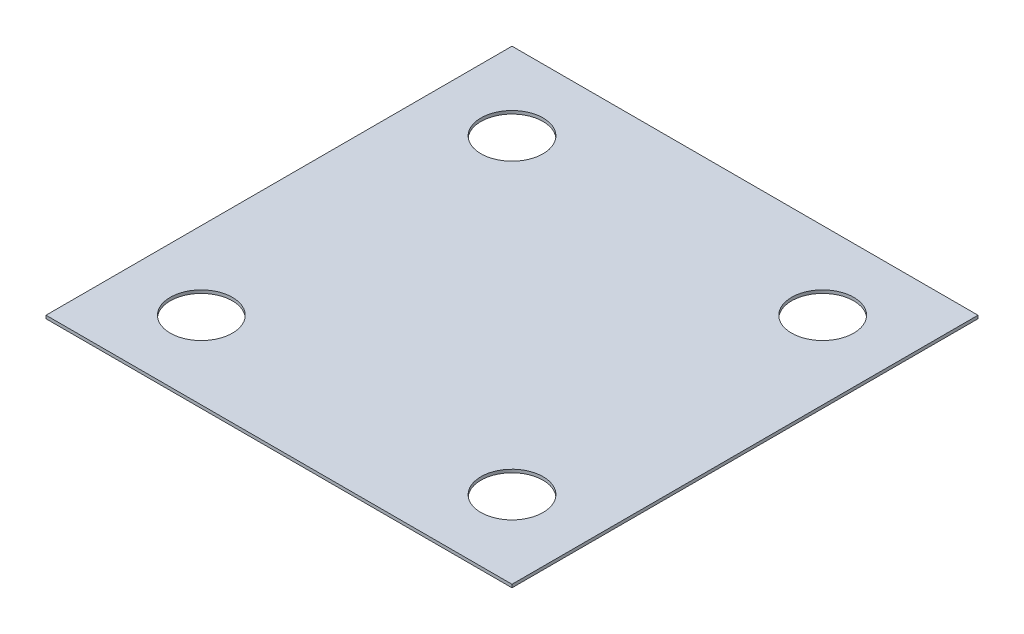
ISO-10303-21;
HEADER;
FILE_DESCRIPTION(('STEP AP214'),'2;1');
FILE_NAME('part.step','',(''),(''),'','','');
FILE_SCHEMA(('AUTOMOTIVE_DESIGN { 1 0 10303 214 1 1 1 1 }'));
ENDSEC;
DATA;
#1=APPLICATION_CONTEXT('core data for automotive mechanical design processes');
#2=APPLICATION_PROTOCOL_DEFINITION('international standard','automotive_design',2000,#1);
#3=PRODUCT_CONTEXT('',#1,'mechanical');
#4=PRODUCT('Part','Part','',(#3));
#5=PRODUCT_RELATED_PRODUCT_CATEGORY('part','',(#4));
#6=PRODUCT_DEFINITION_FORMATION('','',#4);
#7=PRODUCT_DEFINITION_CONTEXT('part definition',#1,'design');
#8=PRODUCT_DEFINITION('design','',#6,#7);
#9=PRODUCT_DEFINITION_SHAPE('','',#8);
#10=(LENGTH_UNIT() NAMED_UNIT(*) SI_UNIT(.MILLI.,.METRE.));
#11=(NAMED_UNIT(*) PLANE_ANGLE_UNIT() SI_UNIT($,.RADIAN.));
#12=(NAMED_UNIT(*) SI_UNIT($,.STERADIAN.) SOLID_ANGLE_UNIT());
#13=UNCERTAINTY_MEASURE_WITH_UNIT(LENGTH_MEASURE(1.E-05),#10,'distance_accuracy_value','');
#14=(GEOMETRIC_REPRESENTATION_CONTEXT(3) GLOBAL_UNCERTAINTY_ASSIGNED_CONTEXT((#13)) GLOBAL_UNIT_ASSIGNED_CONTEXT((#10,
#11,#12)) REPRESENTATION_CONTEXT('',''));
#15=CARTESIAN_POINT('',(0.,0.,0.));
#16=DIRECTION('',(0.,0.,1.));
#17=DIRECTION('',(1.,0.,0.));
#18=AXIS2_PLACEMENT_3D('',#15,#16,#17);
#19=CARTESIAN_POINT('',(150.,-2.,150.));
#20=DIRECTION('',(1.,0.,0.));
#21=DIRECTION('',(0.,0.,-1.));
#22=AXIS2_PLACEMENT_3D('',#19,#20,#21);
#23=PLANE('',#22);
#24=DIRECTION('',(0.,0.,-1.));
#25=VECTOR('',#24,1.);
#26=CARTESIAN_POINT('',(150.,0.,150.));
#27=LINE('',#26,#25);
#28=CARTESIAN_POINT('',(150.,0.,150.));
#29=VERTEX_POINT('',#28);
#30=CARTESIAN_POINT('',(150.,0.,-150.));
#31=VERTEX_POINT('',#30);
#32=EDGE_CURVE('E104',#29,#31,#27,.T.);
#33=ORIENTED_EDGE('',*,*,#32,.F.);
#34=DIRECTION('',(0.,1.,0.));
#35=VECTOR('',#34,1.);
#36=CARTESIAN_POINT('',(150.,-2.,150.));
#37=LINE('',#36,#35);
#38=CARTESIAN_POINT('',(150.,-2.,150.));
#39=VERTEX_POINT('',#38);
#40=EDGE_CURVE('E11',#39,#29,#37,.T.);
#41=ORIENTED_EDGE('',*,*,#40,.F.);
#42=DIRECTION('',(0.,0.,-1.));
#43=VECTOR('',#42,1.);
#44=CARTESIAN_POINT('',(150.,-2.,150.));
#45=LINE('',#44,#43);
#46=CARTESIAN_POINT('',(150.,-2.,-150.));
#47=VERTEX_POINT('',#46);
#48=EDGE_CURVE('E97',#39,#47,#45,.T.);
#49=ORIENTED_EDGE('',*,*,#48,.T.);
#50=DIRECTION('',(0.,1.,0.));
#51=VECTOR('',#50,1.);
#52=CARTESIAN_POINT('',(150.,-2.,-150.));
#53=LINE('',#52,#51);
#54=EDGE_CURVE('E42',#47,#31,#53,.T.);
#55=ORIENTED_EDGE('',*,*,#54,.T.);
#56=EDGE_LOOP('',(#33,#41,#49,#55));
#57=FACE_BOUND('',#56,.T.);
#58=ADVANCED_FACE('F39',(#57),#23,.T.);
#59=CARTESIAN_POINT('',(-150.,-2.,150.));
#60=DIRECTION('',(0.,0.,1.));
#61=DIRECTION('',(1.,0.,0.));
#62=AXIS2_PLACEMENT_3D('',#59,#60,#61);
#63=PLANE('',#62);
#64=DIRECTION('',(1.,0.,0.));
#65=VECTOR('',#64,1.);
#66=CARTESIAN_POINT('',(-150.,0.,150.));
#67=LINE('',#66,#65);
#68=CARTESIAN_POINT('',(-150.,0.,150.));
#69=VERTEX_POINT('',#68);
#70=EDGE_CURVE('E99',#69,#29,#67,.T.);
#71=ORIENTED_EDGE('',*,*,#70,.F.);
#72=DIRECTION('',(0.,1.,0.));
#73=VECTOR('',#72,1.);
#74=CARTESIAN_POINT('',(-150.,-2.,150.));
#75=LINE('',#74,#73);
#76=CARTESIAN_POINT('',(-150.,-2.,150.));
#77=VERTEX_POINT('',#76);
#78=EDGE_CURVE('E48',#77,#69,#75,.T.);
#79=ORIENTED_EDGE('',*,*,#78,.F.);
#80=DIRECTION('',(1.,0.,0.));
#81=VECTOR('',#80,1.);
#82=CARTESIAN_POINT('',(-150.,-2.,150.));
#83=LINE('',#82,#81);
#84=EDGE_CURVE('E94',#77,#39,#83,.T.);
#85=ORIENTED_EDGE('',*,*,#84,.T.);
#86=ORIENTED_EDGE('',*,*,#40,.T.);
#87=EDGE_LOOP('',(#71,#79,#85,#86));
#88=FACE_BOUND('',#87,.T.);
#89=ADVANCED_FACE('F115',(#88),#63,.T.);
#90=CARTESIAN_POINT('',(-150.,-2.,150.));
#91=DIRECTION('',(-1.,0.,0.));
#92=DIRECTION('',(0.,0.,1.));
#93=AXIS2_PLACEMENT_3D('',#90,#91,#92);
#94=PLANE('',#93);
#95=DIRECTION('',(0.,0.,1.));
#96=VECTOR('',#95,1.);
#97=CARTESIAN_POINT('',(-150.,0.,150.));
#98=LINE('',#97,#96);
#99=CARTESIAN_POINT('',(-150.,0.,-150.));
#100=VERTEX_POINT('',#99);
#101=EDGE_CURVE('E89',#100,#69,#98,.T.);
#102=ORIENTED_EDGE('',*,*,#101,.F.);
#103=DIRECTION('',(0.,1.,0.));
#104=VECTOR('',#103,1.);
#105=CARTESIAN_POINT('',(-150.,-2.,-150.));
#106=LINE('',#105,#104);
#107=CARTESIAN_POINT('',(-150.,-2.,-150.));
#108=VERTEX_POINT('',#107);
#109=EDGE_CURVE('E84',#108,#100,#106,.T.);
#110=ORIENTED_EDGE('',*,*,#109,.F.);
#111=DIRECTION('',(0.,0.,1.));
#112=VECTOR('',#111,1.);
#113=CARTESIAN_POINT('',(-150.,-2.,150.));
#114=LINE('',#113,#112);
#115=EDGE_CURVE('E87',#108,#77,#114,.T.);
#116=ORIENTED_EDGE('',*,*,#115,.T.);
#117=ORIENTED_EDGE('',*,*,#78,.T.);
#118=EDGE_LOOP('',(#102,#110,#116,#117));
#119=FACE_BOUND('',#118,.T.);
#120=ADVANCED_FACE('F86',(#119),#94,.T.);
#121=CARTESIAN_POINT('',(-150.,-2.,-150.));
#122=DIRECTION('',(0.,0.,-1.));
#123=DIRECTION('',(-1.,0.,0.));
#124=AXIS2_PLACEMENT_3D('',#121,#122,#123);
#125=PLANE('',#124);
#126=DIRECTION('',(-1.,0.,0.));
#127=VECTOR('',#126,1.);
#128=CARTESIAN_POINT('',(-150.,0.,-150.));
#129=LINE('',#128,#127);
#130=EDGE_CURVE('E107',#31,#100,#129,.T.);
#131=ORIENTED_EDGE('',*,*,#130,.F.);
#132=ORIENTED_EDGE('',*,*,#54,.F.);
#133=DIRECTION('',(-1.,0.,0.));
#134=VECTOR('',#133,1.);
#135=CARTESIAN_POINT('',(-150.,-2.,-150.));
#136=LINE('',#135,#134);
#137=EDGE_CURVE('E93',#47,#108,#136,.T.);
#138=ORIENTED_EDGE('',*,*,#137,.T.);
#139=ORIENTED_EDGE('',*,*,#109,.T.);
#140=EDGE_LOOP('',(#131,#132,#138,#139));
#141=FACE_BOUND('',#140,.T.);
#142=ADVANCED_FACE('F96',(#141),#125,.T.);
#143=CARTESIAN_POINT('',(0.,-2.,0.));
#144=DIRECTION('',(0.,-1.,0.));
#145=DIRECTION('',(0.,0.,-1.));
#146=AXIS2_PLACEMENT_3D('',#143,#144,#145);
#147=PLANE('',#146);
#148=CARTESIAN_POINT('',(-100.,-2.,-100.));
#149=DIRECTION('',(0.,1.,0.));
#150=DIRECTION('',(0.,0.,-1.));
#151=AXIS2_PLACEMENT_3D('',#148,#149,#150);
#152=CIRCLE('',#151,20.);
#153=CARTESIAN_POINT('',(-100.,-2.,-120.));
#154=VERTEX_POINT('',#153);
#155=EDGE_CURVE('E172',#154,#154,#152,.T.);
#156=ORIENTED_EDGE('',*,*,#155,.T.);
#157=EDGE_LOOP('',(#156));
#158=FACE_BOUND('',#157,.T.);
#159=CARTESIAN_POINT('',(-100.,-2.,100.));
#160=DIRECTION('',(0.,1.,0.));
#161=DIRECTION('',(0.,0.,1.));
#162=AXIS2_PLACEMENT_3D('',#159,#160,#161);
#163=CIRCLE('',#162,20.);
#164=CARTESIAN_POINT('',(-100.,-2.,120.));
#165=VERTEX_POINT('',#164);
#166=EDGE_CURVE('E162',#165,#165,#163,.T.);
#167=ORIENTED_EDGE('',*,*,#166,.T.);
#168=EDGE_LOOP('',(#167));
#169=FACE_BOUND('',#168,.T.);
#170=CARTESIAN_POINT('',(100.,-2.,100.));
#171=DIRECTION('',(0.,1.,0.));
#172=DIRECTION('',(0.,0.,-1.));
#173=AXIS2_PLACEMENT_3D('',#170,#171,#172);
#174=CIRCLE('',#173,20.);
#175=CARTESIAN_POINT('',(100.,-2.,80.));
#176=VERTEX_POINT('',#175);
#177=EDGE_CURVE('E157',#176,#176,#174,.T.);
#178=ORIENTED_EDGE('',*,*,#177,.T.);
#179=EDGE_LOOP('',(#178));
#180=FACE_BOUND('',#179,.T.);
#181=CARTESIAN_POINT('',(100.,-2.,-100.));
#182=DIRECTION('',(0.,1.,0.));
#183=DIRECTION('',(0.,0.,1.));
#184=AXIS2_PLACEMENT_3D('',#181,#182,#183);
#185=CIRCLE('',#184,20.);
#186=CARTESIAN_POINT('',(100.,-2.,-80.));
#187=VERTEX_POINT('',#186);
#188=EDGE_CURVE('E108',#187,#187,#185,.T.);
#189=ORIENTED_EDGE('',*,*,#188,.T.);
#190=EDGE_LOOP('',(#189));
#191=FACE_BOUND('',#190,.T.);
#192=ORIENTED_EDGE('',*,*,#48,.F.);
#193=ORIENTED_EDGE('',*,*,#84,.F.);
#194=ORIENTED_EDGE('',*,*,#115,.F.);
#195=ORIENTED_EDGE('',*,*,#137,.F.);
#196=EDGE_LOOP('',(#192,#193,#194,#195));
#197=FACE_BOUND('',#196,.T.);
#198=ADVANCED_FACE('F92',(#158,#169,#180,#191,#197),#147,.T.);
#199=CARTESIAN_POINT('',(0.,0.,0.));
#200=DIRECTION('',(0.,-1.,0.));
#201=DIRECTION('',(0.,0.,-1.));
#202=AXIS2_PLACEMENT_3D('',#199,#200,#201);
#203=PLANE('',#202);
#204=CARTESIAN_POINT('',(-100.,0.,-100.));
#205=DIRECTION('',(0.,1.,0.));
#206=DIRECTION('',(0.,0.,-1.));
#207=AXIS2_PLACEMENT_3D('',#204,#205,#206);
#208=CIRCLE('',#207,20.);
#209=CARTESIAN_POINT('',(-100.,0.,-120.));
#210=VERTEX_POINT('',#209);
#211=EDGE_CURVE('E174',#210,#210,#208,.T.);
#212=ORIENTED_EDGE('',*,*,#211,.F.);
#213=EDGE_LOOP('',(#212));
#214=FACE_BOUND('',#213,.T.);
#215=CARTESIAN_POINT('',(-100.,0.,100.));
#216=DIRECTION('',(0.,1.,0.));
#217=DIRECTION('',(0.,0.,1.));
#218=AXIS2_PLACEMENT_3D('',#215,#216,#217);
#219=CIRCLE('',#218,20.);
#220=CARTESIAN_POINT('',(-100.,0.,120.));
#221=VERTEX_POINT('',#220);
#222=EDGE_CURVE('E167',#221,#221,#219,.T.);
#223=ORIENTED_EDGE('',*,*,#222,.F.);
#224=EDGE_LOOP('',(#223));
#225=FACE_BOUND('',#224,.T.);
#226=CARTESIAN_POINT('',(100.,0.,100.));
#227=DIRECTION('',(0.,1.,0.));
#228=DIRECTION('',(0.,0.,-1.));
#229=AXIS2_PLACEMENT_3D('',#226,#227,#228);
#230=CIRCLE('',#229,20.);
#231=CARTESIAN_POINT('',(100.,0.,80.));
#232=VERTEX_POINT('',#231);
#233=EDGE_CURVE('E160',#232,#232,#230,.T.);
#234=ORIENTED_EDGE('',*,*,#233,.F.);
#235=EDGE_LOOP('',(#234));
#236=FACE_BOUND('',#235,.T.);
#237=CARTESIAN_POINT('',(100.,0.,-100.));
#238=DIRECTION('',(0.,1.,0.));
#239=DIRECTION('',(0.,0.,1.));
#240=AXIS2_PLACEMENT_3D('',#237,#238,#239);
#241=CIRCLE('',#240,20.);
#242=CARTESIAN_POINT('',(100.,0.,-80.));
#243=VERTEX_POINT('',#242);
#244=EDGE_CURVE('E164',#243,#243,#241,.T.);
#245=ORIENTED_EDGE('',*,*,#244,.F.);
#246=EDGE_LOOP('',(#245));
#247=FACE_BOUND('',#246,.T.);
#248=ORIENTED_EDGE('',*,*,#32,.T.);
#249=ORIENTED_EDGE('',*,*,#130,.T.);
#250=ORIENTED_EDGE('',*,*,#101,.T.);
#251=ORIENTED_EDGE('',*,*,#70,.T.);
#252=EDGE_LOOP('',(#248,#249,#250,#251));
#253=FACE_BOUND('',#252,.T.);
#254=ADVANCED_FACE('F114',(#214,#225,#236,#247,#253),#203,.F.);
#255=CARTESIAN_POINT('',(100.,-2.,-100.));
#256=DIRECTION('',(0.,1.,0.));
#257=DIRECTION('',(0.,0.,1.));
#258=AXIS2_PLACEMENT_3D('',#255,#256,#257);
#259=CYLINDRICAL_SURFACE('',#258,20.);
#260=ORIENTED_EDGE('',*,*,#188,.F.);
#261=EDGE_LOOP('',(#260));
#262=FACE_BOUND('',#261,.T.);
#263=ORIENTED_EDGE('',*,*,#244,.T.);
#264=EDGE_LOOP('',(#263));
#265=FACE_BOUND('',#264,.T.);
#266=ADVANCED_FACE('F133',(#262,#265),#259,.F.);
#267=CARTESIAN_POINT('',(100.,-2.,100.));
#268=DIRECTION('',(0.,1.,0.));
#269=DIRECTION('',(0.,0.,1.));
#270=AXIS2_PLACEMENT_3D('',#267,#268,#269);
#271=CYLINDRICAL_SURFACE('',#270,20.);
#272=ORIENTED_EDGE('',*,*,#177,.F.);
#273=EDGE_LOOP('',(#272));
#274=FACE_BOUND('',#273,.T.);
#275=ORIENTED_EDGE('',*,*,#233,.T.);
#276=EDGE_LOOP('',(#275));
#277=FACE_BOUND('',#276,.T.);
#278=ADVANCED_FACE('F140',(#274,#277),#271,.F.);
#279=CARTESIAN_POINT('',(-100.,-2.,100.));
#280=DIRECTION('',(0.,1.,0.));
#281=DIRECTION('',(0.,0.,1.));
#282=AXIS2_PLACEMENT_3D('',#279,#280,#281);
#283=CYLINDRICAL_SURFACE('',#282,20.);
#284=ORIENTED_EDGE('',*,*,#166,.F.);
#285=EDGE_LOOP('',(#284));
#286=FACE_BOUND('',#285,.T.);
#287=ORIENTED_EDGE('',*,*,#222,.T.);
#288=EDGE_LOOP('',(#287));
#289=FACE_BOUND('',#288,.T.);
#290=ADVANCED_FACE('F145',(#286,#289),#283,.F.);
#291=CARTESIAN_POINT('',(-100.,-2.,-100.));
#292=DIRECTION('',(0.,1.,0.));
#293=DIRECTION('',(0.,0.,1.));
#294=AXIS2_PLACEMENT_3D('',#291,#292,#293);
#295=CYLINDRICAL_SURFACE('',#294,20.);
#296=ORIENTED_EDGE('',*,*,#155,.F.);
#297=EDGE_LOOP('',(#296));
#298=FACE_BOUND('',#297,.T.);
#299=ORIENTED_EDGE('',*,*,#211,.T.);
#300=EDGE_LOOP('',(#299));
#301=FACE_BOUND('',#300,.T.);
#302=ADVANCED_FACE('F142',(#298,#301),#295,.F.);
#303=CLOSED_SHELL('',(#58,#89,#120,#142,#198,#254,#266,#278,#290,#302));
#304=MANIFOLD_SOLID_BREP('B2',#303);
#305=ADVANCED_BREP_SHAPE_REPRESENTATION('',(#18,#304),#14);
#306=SHAPE_DEFINITION_REPRESENTATION(#9,#305);
ENDSEC;
END-ISO-10303-21;
